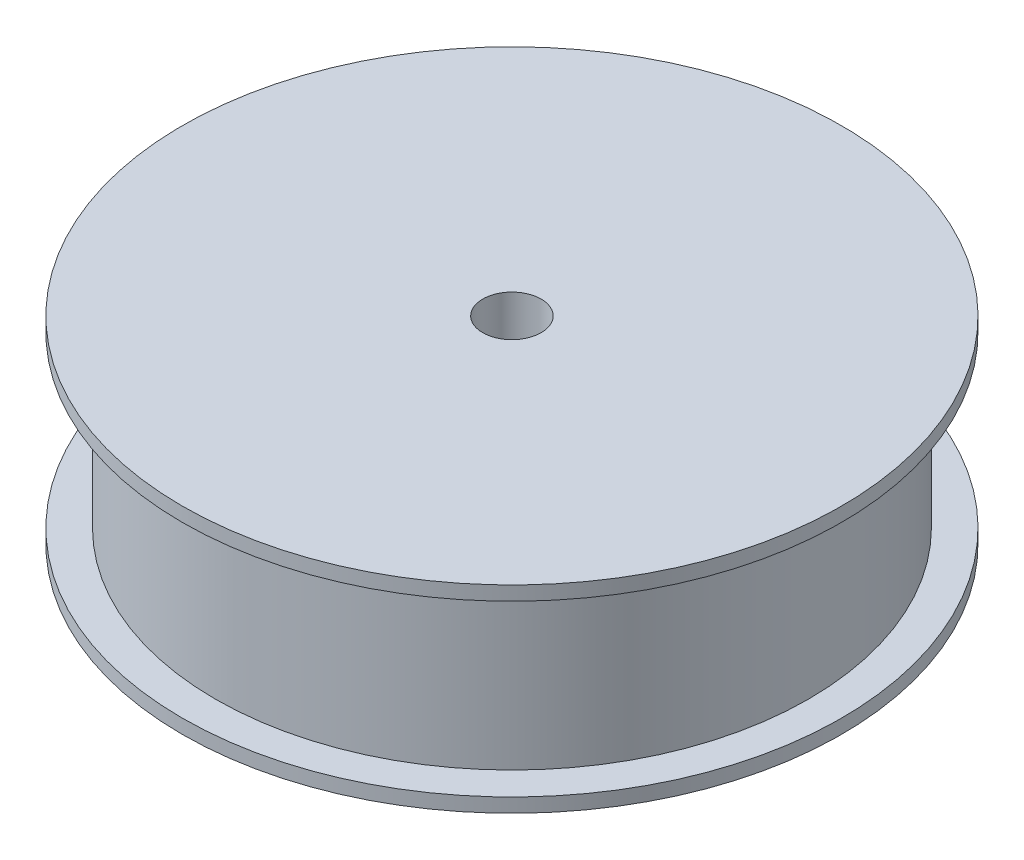
ISO-10303-21;
HEADER;
FILE_DESCRIPTION(('STEP AP214'),'2;1');
FILE_NAME('part.step','',(''),(''),'','','');
FILE_SCHEMA(('AUTOMOTIVE_DESIGN { 1 0 10303 214 1 1 1 1 }'));
ENDSEC;
DATA;
#1=APPLICATION_CONTEXT('core data for automotive mechanical design processes');
#2=APPLICATION_PROTOCOL_DEFINITION('international standard','automotive_design',2000,#1);
#3=PRODUCT_CONTEXT('',#1,'mechanical');
#4=PRODUCT('Part','Part','',(#3));
#5=PRODUCT_RELATED_PRODUCT_CATEGORY('part','',(#4));
#6=PRODUCT_DEFINITION_FORMATION('','',#4);
#7=PRODUCT_DEFINITION_CONTEXT('part definition',#1,'design');
#8=PRODUCT_DEFINITION('design','',#6,#7);
#9=PRODUCT_DEFINITION_SHAPE('','',#8);
#10=(LENGTH_UNIT() NAMED_UNIT(*) SI_UNIT(.MILLI.,.METRE.));
#11=(NAMED_UNIT(*) PLANE_ANGLE_UNIT() SI_UNIT($,.RADIAN.));
#12=(NAMED_UNIT(*) SI_UNIT($,.STERADIAN.) SOLID_ANGLE_UNIT());
#13=UNCERTAINTY_MEASURE_WITH_UNIT(LENGTH_MEASURE(1.E-05),#10,'distance_accuracy_value','');
#14=(GEOMETRIC_REPRESENTATION_CONTEXT(3) GLOBAL_UNCERTAINTY_ASSIGNED_CONTEXT((#13)) GLOBAL_UNIT_ASSIGNED_CONTEXT((#10,
#11,#12)) REPRESENTATION_CONTEXT('',''));
#15=CARTESIAN_POINT('',(0.,0.,0.));
#16=DIRECTION('',(0.,0.,1.));
#17=DIRECTION('',(1.,0.,0.));
#18=AXIS2_PLACEMENT_3D('',#15,#16,#17);
#19=CARTESIAN_POINT('',(0.,1.5,0.));
#20=DIRECTION('',(0.,-1.,0.));
#21=DIRECTION('',(0.,0.,-1.));
#22=AXIS2_PLACEMENT_3D('',#19,#20,#21);
#23=CYLINDRICAL_SURFACE('',#22,35.);
#24=CARTESIAN_POINT('',(0.,1.5,0.));
#25=DIRECTION('',(0.,1.,0.));
#26=DIRECTION('',(0.,0.,1.));
#27=AXIS2_PLACEMENT_3D('',#24,#25,#26);
#28=CIRCLE('',#27,35.);
#29=CARTESIAN_POINT('',(0.,1.5,35.));
#30=VERTEX_POINT('',#29);
#31=EDGE_CURVE('E39',#30,#30,#28,.T.);
#32=ORIENTED_EDGE('',*,*,#31,.F.);
#33=EDGE_LOOP('',(#32));
#34=FACE_BOUND('',#33,.T.);
#35=CARTESIAN_POINT('',(0.,0.,0.));
#36=DIRECTION('',(0.,1.,0.));
#37=DIRECTION('',(0.,0.,1.));
#38=AXIS2_PLACEMENT_3D('',#35,#36,#37);
#39=CIRCLE('',#38,35.);
#40=CARTESIAN_POINT('',(0.,0.,35.));
#41=VERTEX_POINT('',#40);
#42=EDGE_CURVE('E35',#41,#41,#39,.T.);
#43=ORIENTED_EDGE('',*,*,#42,.T.);
#44=EDGE_LOOP('',(#43));
#45=FACE_BOUND('',#44,.T.);
#46=ADVANCED_FACE('F32',(#34,#45),#23,.T.);
#47=CARTESIAN_POINT('',(0.,1.5,0.));
#48=DIRECTION('',(0.,1.,0.));
#49=DIRECTION('',(0.,0.,1.));
#50=AXIS2_PLACEMENT_3D('',#47,#48,#49);
#51=PLANE('',#50);
#52=CARTESIAN_POINT('',(0.,1.5,0.));
#53=DIRECTION('',(0.,1.,0.));
#54=DIRECTION('',(0.,0.,1.));
#55=AXIS2_PLACEMENT_3D('',#52,#53,#54);
#56=CIRCLE('',#55,31.5);
#57=CARTESIAN_POINT('',(0.,1.5,31.5));
#58=VERTEX_POINT('',#57);
#59=EDGE_CURVE('E10',#58,#58,#56,.T.);
#60=ORIENTED_EDGE('',*,*,#59,.F.);
#61=EDGE_LOOP('',(#60));
#62=FACE_BOUND('',#61,.T.);
#63=ORIENTED_EDGE('',*,*,#31,.T.);
#64=EDGE_LOOP('',(#63));
#65=FACE_BOUND('',#64,.T.);
#66=ADVANCED_FACE('F90',(#62,#65),#51,.T.);
#67=CARTESIAN_POINT('',(0.,0.,0.));
#68=DIRECTION('',(0.,1.,0.));
#69=DIRECTION('',(0.,0.,1.));
#70=AXIS2_PLACEMENT_3D('',#67,#68,#69);
#71=PLANE('',#70);
#72=CARTESIAN_POINT('',(0.,0.,0.));
#73=DIRECTION('',(0.,1.,0.));
#74=DIRECTION('',(0.,0.,1.));
#75=AXIS2_PLACEMENT_3D('',#72,#73,#74);
#76=CIRCLE('',#75,3.1);
#77=CARTESIAN_POINT('',(0.,0.,3.1));
#78=VERTEX_POINT('',#77);
#79=EDGE_CURVE('E52',#78,#78,#76,.T.);
#80=ORIENTED_EDGE('',*,*,#79,.T.);
#81=EDGE_LOOP('',(#80));
#82=FACE_BOUND('',#81,.T.);
#83=ORIENTED_EDGE('',*,*,#42,.F.);
#84=EDGE_LOOP('',(#83));
#85=FACE_BOUND('',#84,.T.);
#86=ADVANCED_FACE('F61',(#82,#85),#71,.F.);
#87=CARTESIAN_POINT('',(0.,19.5,0.));
#88=DIRECTION('',(0.,-1.,0.));
#89=DIRECTION('',(0.,0.,-1.));
#90=AXIS2_PLACEMENT_3D('',#87,#88,#89);
#91=CYLINDRICAL_SURFACE('',#90,31.5);
#92=CARTESIAN_POINT('',(0.,19.5,0.));
#93=DIRECTION('',(0.,1.,0.));
#94=DIRECTION('',(0.,0.,1.));
#95=AXIS2_PLACEMENT_3D('',#92,#93,#94);
#96=CIRCLE('',#95,31.5);
#97=CARTESIAN_POINT('',(0.,19.5,31.5));
#98=VERTEX_POINT('',#97);
#99=EDGE_CURVE('E45',#98,#98,#96,.T.);
#100=ORIENTED_EDGE('',*,*,#99,.F.);
#101=EDGE_LOOP('',(#100));
#102=FACE_BOUND('',#101,.T.);
#103=ORIENTED_EDGE('',*,*,#59,.T.);
#104=EDGE_LOOP('',(#103));
#105=FACE_BOUND('',#104,.T.);
#106=ADVANCED_FACE('F80',(#102,#105),#91,.T.);
#107=CARTESIAN_POINT('',(0.,21.,0.));
#108=DIRECTION('',(0.,-1.,0.));
#109=DIRECTION('',(0.,0.,-1.));
#110=AXIS2_PLACEMENT_3D('',#107,#108,#109);
#111=CYLINDRICAL_SURFACE('',#110,35.);
#112=CARTESIAN_POINT('',(0.,21.,0.));
#113=DIRECTION('',(0.,1.,0.));
#114=DIRECTION('',(0.,0.,1.));
#115=AXIS2_PLACEMENT_3D('',#112,#113,#114);
#116=CIRCLE('',#115,35.);
#117=CARTESIAN_POINT('',(0.,21.,35.));
#118=VERTEX_POINT('',#117);
#119=EDGE_CURVE('E48',#118,#118,#116,.T.);
#120=ORIENTED_EDGE('',*,*,#119,.F.);
#121=EDGE_LOOP('',(#120));
#122=FACE_BOUND('',#121,.T.);
#123=CARTESIAN_POINT('',(0.,19.5,0.));
#124=DIRECTION('',(0.,1.,0.));
#125=DIRECTION('',(0.,0.,1.));
#126=AXIS2_PLACEMENT_3D('',#123,#124,#125);
#127=CIRCLE('',#126,35.);
#128=CARTESIAN_POINT('',(0.,19.5,35.));
#129=VERTEX_POINT('',#128);
#130=EDGE_CURVE('E49',#129,#129,#127,.T.);
#131=ORIENTED_EDGE('',*,*,#130,.T.);
#132=EDGE_LOOP('',(#131));
#133=FACE_BOUND('',#132,.T.);
#134=ADVANCED_FACE('F74',(#122,#133),#111,.T.);
#135=CARTESIAN_POINT('',(0.,21.,0.));
#136=DIRECTION('',(0.,1.,0.));
#137=DIRECTION('',(0.,0.,1.));
#138=AXIS2_PLACEMENT_3D('',#135,#136,#137);
#139=PLANE('',#138);
#140=CARTESIAN_POINT('',(0.,21.,0.));
#141=DIRECTION('',(0.,1.,0.));
#142=DIRECTION('',(0.,0.,1.));
#143=AXIS2_PLACEMENT_3D('',#140,#141,#142);
#144=CIRCLE('',#143,3.1);
#145=CARTESIAN_POINT('',(0.,21.,3.1));
#146=VERTEX_POINT('',#145);
#147=EDGE_CURVE('E55',#146,#146,#144,.T.);
#148=ORIENTED_EDGE('',*,*,#147,.F.);
#149=EDGE_LOOP('',(#148));
#150=FACE_BOUND('',#149,.T.);
#151=ORIENTED_EDGE('',*,*,#119,.T.);
#152=EDGE_LOOP('',(#151));
#153=FACE_BOUND('',#152,.T.);
#154=ADVANCED_FACE('F71',(#150,#153),#139,.T.);
#155=CARTESIAN_POINT('',(0.,19.5,0.));
#156=DIRECTION('',(0.,1.,0.));
#157=DIRECTION('',(0.,0.,1.));
#158=AXIS2_PLACEMENT_3D('',#155,#156,#157);
#159=PLANE('',#158);
#160=ORIENTED_EDGE('',*,*,#99,.T.);
#161=EDGE_LOOP('',(#160));
#162=FACE_BOUND('',#161,.T.);
#163=ORIENTED_EDGE('',*,*,#130,.F.);
#164=EDGE_LOOP('',(#163));
#165=FACE_BOUND('',#164,.T.);
#166=ADVANCED_FACE('F67',(#162,#165),#159,.F.);
#167=CARTESIAN_POINT('',(0.,0.,0.));
#168=DIRECTION('',(0.,1.,0.));
#169=DIRECTION('',(0.,0.,1.));
#170=AXIS2_PLACEMENT_3D('',#167,#168,#169);
#171=CYLINDRICAL_SURFACE('',#170,3.1);
#172=ORIENTED_EDGE('',*,*,#79,.F.);
#173=EDGE_LOOP('',(#172));
#174=FACE_BOUND('',#173,.T.);
#175=ORIENTED_EDGE('',*,*,#147,.T.);
#176=EDGE_LOOP('',(#175));
#177=FACE_BOUND('',#176,.T.);
#178=ADVANCED_FACE('F64',(#174,#177),#171,.F.);
#179=CLOSED_SHELL('',(#46,#66,#86,#106,#134,#154,#166,#178));
#180=MANIFOLD_SOLID_BREP('B2',#179);
#181=ADVANCED_BREP_SHAPE_REPRESENTATION('',(#18,#180),#14);
#182=SHAPE_DEFINITION_REPRESENTATION(#9,#181);
ENDSEC;
END-ISO-10303-21;
